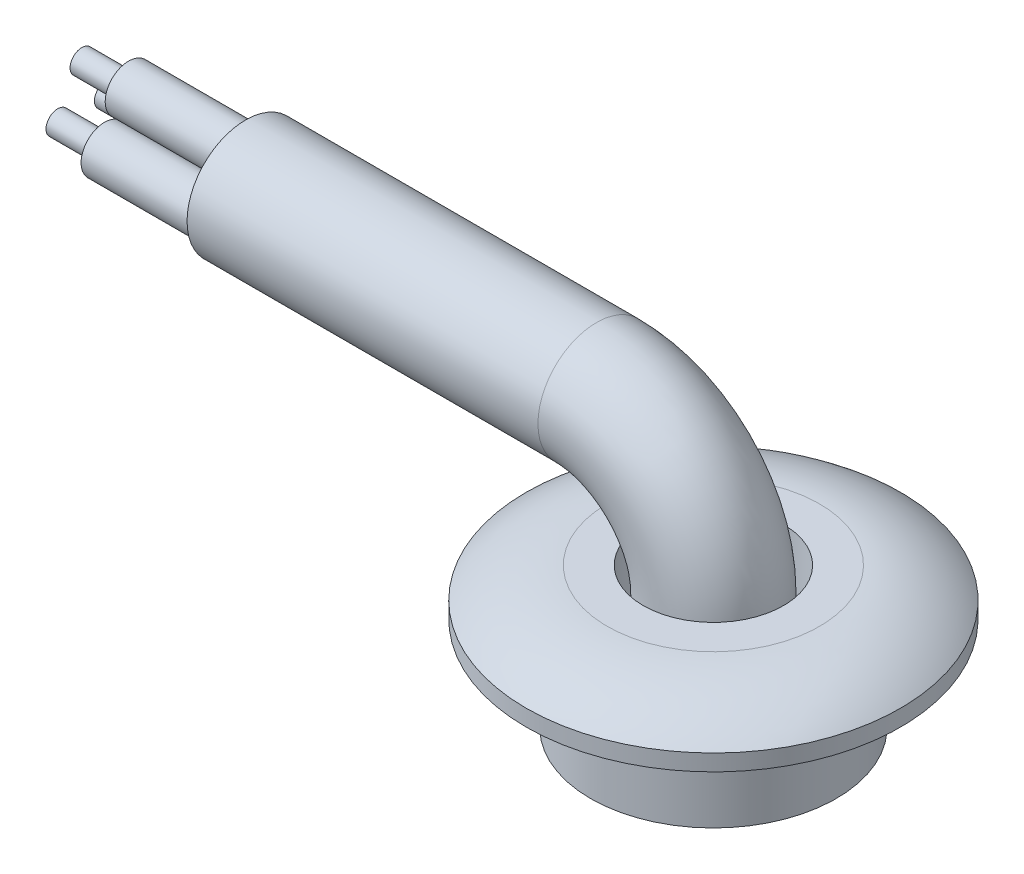
ISO-10303-21;
HEADER;
FILE_DESCRIPTION(('STEP AP214'),'2;1');
FILE_NAME('part.step','',(''),(''),'','','');
FILE_SCHEMA(('AUTOMOTIVE_DESIGN { 1 0 10303 214 1 1 1 1 }'));
ENDSEC;
DATA;
#1=APPLICATION_CONTEXT('core data for automotive mechanical design processes');
#2=APPLICATION_PROTOCOL_DEFINITION('international standard','automotive_design',2000,#1);
#3=PRODUCT_CONTEXT('',#1,'mechanical');
#4=PRODUCT('Part','Part','',(#3));
#5=PRODUCT_RELATED_PRODUCT_CATEGORY('part','',(#4));
#6=PRODUCT_DEFINITION_FORMATION('','',#4);
#7=PRODUCT_DEFINITION_CONTEXT('part definition',#1,'design');
#8=PRODUCT_DEFINITION('design','',#6,#7);
#9=PRODUCT_DEFINITION_SHAPE('','',#8);
#10=(LENGTH_UNIT() NAMED_UNIT(*) SI_UNIT(.MILLI.,.METRE.));
#11=(NAMED_UNIT(*) PLANE_ANGLE_UNIT() SI_UNIT($,.RADIAN.));
#12=(NAMED_UNIT(*) SI_UNIT($,.STERADIAN.) SOLID_ANGLE_UNIT());
#13=UNCERTAINTY_MEASURE_WITH_UNIT(LENGTH_MEASURE(1.E-05),#10,'distance_accuracy_value','');
#14=(GEOMETRIC_REPRESENTATION_CONTEXT(3) GLOBAL_UNCERTAINTY_ASSIGNED_CONTEXT((#13)) GLOBAL_UNIT_ASSIGNED_CONTEXT((#10,
#11,#12)) REPRESENTATION_CONTEXT('',''));
#15=CARTESIAN_POINT('',(0.,0.,0.));
#16=DIRECTION('',(0.,0.,1.));
#17=DIRECTION('',(1.,0.,0.));
#18=AXIS2_PLACEMENT_3D('',#15,#16,#17);
#19=CARTESIAN_POINT('',(0.,0.,0.));
#20=DIRECTION('',(0.,1.,0.));
#21=DIRECTION('',(0.,0.,1.));
#22=AXIS2_PLACEMENT_3D('',#19,#20,#21);
#23=PLANE('',#22);
#24=CARTESIAN_POINT('',(0.,0.,0.));
#25=DIRECTION('',(0.,1.,0.));
#26=DIRECTION('',(0.,0.,1.));
#27=AXIS2_PLACEMENT_3D('',#24,#25,#26);
#28=CIRCLE('',#27,3.);
#29=CARTESIAN_POINT('',(0.,0.,3.));
#30=VERTEX_POINT('',#29);
#31=EDGE_CURVE('P0_E18',#30,#30,#28,.F.);
#32=ORIENTED_EDGE('',*,*,#31,.T.);
#33=EDGE_LOOP('',(#32));
#34=FACE_BOUND('',#33,.T.);
#35=CARTESIAN_POINT('',(0.,1.27502175484295E-13,-1.07937828253817E-12));
#36=DIRECTION('',(0.,1.,0.));
#37=DIRECTION('',(-1.,0.,0.));
#38=AXIS2_PLACEMENT_3D('',#35,#36,#37);
#39=CIRCLE('',#38,4.537919700527);
#40=CARTESIAN_POINT('',(-4.537919700527,1.27303706766758E-13,-1.07937828253817E-12));
#41=VERTEX_POINT('',#40);
#42=EDGE_CURVE('P0_E36',#41,#41,#39,.F.);
#43=ORIENTED_EDGE('',*,*,#42,.F.);
#44=EDGE_LOOP('',(#43));
#45=FACE_BOUND('',#44,.T.);
#46=ADVANCED_FACE('P0_F14',(#34,#45),#23,.T.);
#47=CARTESIAN_POINT('',(0.,0.,0.));
#48=DIRECTION('',(0.,1.,0.));
#49=DIRECTION('',(0.,0.,1.));
#50=AXIS2_PLACEMENT_3D('',#47,#48,#49);
#51=CYLINDRICAL_SURFACE('',#50,3.);
#52=ORIENTED_EDGE('',*,*,#31,.F.);
#53=EDGE_LOOP('',(#52));
#54=FACE_BOUND('',#53,.T.);
#55=CARTESIAN_POINT('',(0.,-6.02,0.));
#56=DIRECTION('',(0.,1.,0.));
#57=DIRECTION('',(0.,0.,1.));
#58=AXIS2_PLACEMENT_3D('',#55,#56,#57);
#59=CIRCLE('',#58,3.);
#60=CARTESIAN_POINT('',(0.,-6.02,3.));
#61=VERTEX_POINT('',#60);
#62=EDGE_CURVE('P0_E34',#61,#61,#59,.F.);
#63=ORIENTED_EDGE('',*,*,#62,.T.);
#64=EDGE_LOOP('',(#63));
#65=FACE_BOUND('',#64,.T.);
#66=ADVANCED_FACE('P0_F45',(#54,#65),#51,.F.);
#67=CARTESIAN_POINT('',(0.,-5.25999999999844,-1.07959431325244E-12));
#68=DIRECTION('',(0.,1.,0.));
#69=DIRECTION('',(-1.,0.,0.));
#70=AXIS2_PLACEMENT_3D('',#67,#68,#69);
#71=DEGENERATE_TOROIDAL_SURFACE('',#70,4.53791970052708,5.25999999999857,.T.);
#72=CARTESIAN_POINT('',(0.,-1.3,0.));
#73=DIRECTION('',(0.,1.,0.));
#74=DIRECTION('',(0.,0.,1.));
#75=AXIS2_PLACEMENT_3D('',#72,#73,#74);
#76=CIRCLE('',#75,8.);
#77=CARTESIAN_POINT('',(0.,-1.3,8.));
#78=VERTEX_POINT('',#77);
#79=EDGE_CURVE('P0_E30',#78,#78,#76,.F.);
#80=ORIENTED_EDGE('',*,*,#79,.F.);
#81=EDGE_LOOP('',(#80));
#82=FACE_BOUND('',#81,.T.);
#83=ORIENTED_EDGE('',*,*,#42,.T.);
#84=EDGE_LOOP('',(#83));
#85=FACE_BOUND('',#84,.T.);
#86=ADVANCED_FACE('P0_F16',(#82,#85),#71,.T.);
#87=CARTESIAN_POINT('',(0.,-6.02,0.));
#88=DIRECTION('',(0.,1.,0.));
#89=DIRECTION('',(0.,0.,1.));
#90=AXIS2_PLACEMENT_3D('',#87,#88,#89);
#91=PLANE('',#90);
#92=ORIENTED_EDGE('',*,*,#62,.F.);
#93=EDGE_LOOP('',(#92));
#94=FACE_BOUND('',#93,.T.);
#95=CARTESIAN_POINT('',(0.,-6.02,0.));
#96=DIRECTION('',(0.,1.,0.));
#97=DIRECTION('',(0.,0.,1.));
#98=AXIS2_PLACEMENT_3D('',#95,#96,#97);
#99=CIRCLE('',#98,5.25);
#100=CARTESIAN_POINT('',(0.,-6.02,5.25));
#101=VERTEX_POINT('',#100);
#102=EDGE_CURVE('P0_E27',#101,#101,#99,.T.);
#103=ORIENTED_EDGE('',*,*,#102,.F.);
#104=EDGE_LOOP('',(#103));
#105=FACE_BOUND('',#104,.T.);
#106=ADVANCED_FACE('P0_F51',(#94,#105),#91,.F.);
#107=CARTESIAN_POINT('',(0.,-6.321,0.));
#108=DIRECTION('',(0.,1.,0.));
#109=DIRECTION('',(0.,0.,1.));
#110=AXIS2_PLACEMENT_3D('',#107,#108,#109);
#111=CYLINDRICAL_SURFACE('',#110,8.);
#112=CARTESIAN_POINT('',(0.,-2.,0.));
#113=DIRECTION('',(0.,1.,0.));
#114=DIRECTION('',(0.,0.,1.));
#115=AXIS2_PLACEMENT_3D('',#112,#113,#114);
#116=CIRCLE('',#115,8.);
#117=CARTESIAN_POINT('',(0.,-2.,8.));
#118=VERTEX_POINT('',#117);
#119=EDGE_CURVE('P0_E22',#118,#118,#116,.T.);
#120=ORIENTED_EDGE('',*,*,#119,.T.);
#121=EDGE_LOOP('',(#120));
#122=FACE_BOUND('',#121,.T.);
#123=ORIENTED_EDGE('',*,*,#79,.T.);
#124=EDGE_LOOP('',(#123));
#125=FACE_BOUND('',#124,.T.);
#126=ADVANCED_FACE('P0_F54',(#122,#125),#111,.T.);
#127=CARTESIAN_POINT('',(0.,-6.321,0.));
#128=DIRECTION('',(0.,1.,0.));
#129=DIRECTION('',(0.,0.,1.));
#130=AXIS2_PLACEMENT_3D('',#127,#128,#129);
#131=CYLINDRICAL_SURFACE('',#130,5.25);
#132=CARTESIAN_POINT('',(0.,-2.,0.));
#133=DIRECTION('',(0.,1.,0.));
#134=DIRECTION('',(0.,0.,1.));
#135=AXIS2_PLACEMENT_3D('',#132,#133,#134);
#136=CIRCLE('',#135,5.25);
#137=CARTESIAN_POINT('',(0.,-2.,5.25));
#138=VERTEX_POINT('',#137);
#139=EDGE_CURVE('P0_E10',#138,#138,#136,.F.);
#140=ORIENTED_EDGE('',*,*,#139,.T.);
#141=EDGE_LOOP('',(#140));
#142=FACE_BOUND('',#141,.T.);
#143=ORIENTED_EDGE('',*,*,#102,.T.);
#144=EDGE_LOOP('',(#143));
#145=FACE_BOUND('',#144,.T.);
#146=ADVANCED_FACE('P0_F58',(#142,#145),#131,.T.);
#147=CARTESIAN_POINT('',(0.,-2.,0.));
#148=DIRECTION('',(0.,1.,0.));
#149=DIRECTION('',(0.,0.,1.));
#150=AXIS2_PLACEMENT_3D('',#147,#148,#149);
#151=PLANE('',#150);
#152=ORIENTED_EDGE('',*,*,#139,.F.);
#153=EDGE_LOOP('',(#152));
#154=FACE_BOUND('',#153,.T.);
#155=ORIENTED_EDGE('',*,*,#119,.F.);
#156=EDGE_LOOP('',(#155));
#157=FACE_BOUND('',#156,.T.);
#158=ADVANCED_FACE('P0_F60',(#154,#157),#151,.F.);
#159=CLOSED_SHELL('',(#46,#66,#86,#106,#126,#146,#158));
#160=MANIFOLD_SOLID_BREP('P0_B1',#159);
#161=CARTESIAN_POINT('',(-27.,0.,0.));
#162=DIRECTION('',(-1.,0.,0.));
#163=DIRECTION('',(0.,0.,1.));
#164=AXIS2_PLACEMENT_3D('',#161,#162,#163);
#165=PLANE('',#164);
#166=CARTESIAN_POINT('',(-27.,5.16,0.));
#167=DIRECTION('',(-1.,0.,0.));
#168=DIRECTION('',(0.,0.,1.));
#169=AXIS2_PLACEMENT_3D('',#166,#167,#168);
#170=CIRCLE('',#169,0.5);
#171=CARTESIAN_POINT('',(-27.,5.16,0.5));
#172=VERTEX_POINT('',#171);
#173=EDGE_CURVE('P1_E17',#172,#172,#170,.F.);
#174=ORIENTED_EDGE('',*,*,#173,.F.);
#175=EDGE_LOOP('',(#174));
#176=FACE_BOUND('',#175,.T.);
#177=ADVANCED_FACE('P1_F14',(#176),#165,.T.);
#178=CARTESIAN_POINT('',(-27.,0.,0.));
#179=DIRECTION('',(-1.,0.,0.));
#180=DIRECTION('',(0.,0.,1.));
#181=AXIS2_PLACEMENT_3D('',#178,#179,#180);
#182=PLANE('',#181);
#183=CARTESIAN_POINT('',(-27.,3.41,-1.04));
#184=DIRECTION('',(-1.,0.,0.));
#185=DIRECTION('',(0.,0.,1.));
#186=AXIS2_PLACEMENT_3D('',#183,#184,#185);
#187=CIRCLE('',#186,0.5);
#188=CARTESIAN_POINT('',(-27.,3.41,-0.54));
#189=VERTEX_POINT('',#188);
#190=EDGE_CURVE('P1_E65',#189,#189,#187,.F.);
#191=ORIENTED_EDGE('',*,*,#190,.F.);
#192=EDGE_LOOP('',(#191));
#193=FACE_BOUND('',#192,.T.);
#194=ADVANCED_FACE('P1_F76',(#193),#182,.T.);
#195=CARTESIAN_POINT('',(-27.,0.,0.));
#196=DIRECTION('',(-1.,0.,0.));
#197=DIRECTION('',(0.,0.,1.));
#198=AXIS2_PLACEMENT_3D('',#195,#196,#197);
#199=PLANE('',#198);
#200=CARTESIAN_POINT('',(-27.,3.41,1.03));
#201=DIRECTION('',(-1.,0.,0.));
#202=DIRECTION('',(0.,0.,1.));
#203=AXIS2_PLACEMENT_3D('',#200,#201,#202);
#204=CIRCLE('',#203,0.5);
#205=CARTESIAN_POINT('',(-27.,3.41,1.53));
#206=VERTEX_POINT('',#205);
#207=EDGE_CURVE('P1_E63',#206,#206,#204,.F.);
#208=ORIENTED_EDGE('',*,*,#207,.F.);
#209=EDGE_LOOP('',(#208));
#210=FACE_BOUND('',#209,.T.);
#211=ADVANCED_FACE('P1_F81',(#210),#199,.T.);
#212=CARTESIAN_POINT('',(-25.,5.16,0.));
#213=DIRECTION('',(-1.,0.,0.));
#214=DIRECTION('',(0.,0.,1.));
#215=AXIS2_PLACEMENT_3D('',#212,#213,#214);
#216=CYLINDRICAL_SURFACE('',#215,0.5);
#217=ORIENTED_EDGE('',*,*,#173,.T.);
#218=EDGE_LOOP('',(#217));
#219=FACE_BOUND('',#218,.T.);
#220=CARTESIAN_POINT('',(-25.,5.16,0.));
#221=DIRECTION('',(-1.,0.,0.));
#222=DIRECTION('',(0.,0.,1.));
#223=AXIS2_PLACEMENT_3D('',#220,#221,#222);
#224=CIRCLE('',#223,0.5);
#225=CARTESIAN_POINT('',(-25.,5.16,0.5));
#226=VERTEX_POINT('',#225);
#227=EDGE_CURVE('P1_E60',#226,#226,#224,.F.);
#228=ORIENTED_EDGE('',*,*,#227,.F.);
#229=EDGE_LOOP('',(#228));
#230=FACE_BOUND('',#229,.T.);
#231=ADVANCED_FACE('P1_F72',(#219,#230),#216,.T.);
#232=CARTESIAN_POINT('',(-25.,3.41,-1.04));
#233=DIRECTION('',(-1.,0.,0.));
#234=DIRECTION('',(0.,0.,1.));
#235=AXIS2_PLACEMENT_3D('',#232,#233,#234);
#236=CYLINDRICAL_SURFACE('',#235,0.5);
#237=ORIENTED_EDGE('',*,*,#190,.T.);
#238=EDGE_LOOP('',(#237));
#239=FACE_BOUND('',#238,.T.);
#240=CARTESIAN_POINT('',(-25.,3.41,-1.04));
#241=DIRECTION('',(-1.,0.,0.));
#242=DIRECTION('',(0.,0.,1.));
#243=AXIS2_PLACEMENT_3D('',#240,#241,#242);
#244=CIRCLE('',#243,0.5);
#245=CARTESIAN_POINT('',(-25.,3.41,-0.54));
#246=VERTEX_POINT('',#245);
#247=EDGE_CURVE('P1_E57',#246,#246,#244,.F.);
#248=ORIENTED_EDGE('',*,*,#247,.F.);
#249=EDGE_LOOP('',(#248));
#250=FACE_BOUND('',#249,.T.);
#251=ADVANCED_FACE('P1_F133',(#239,#250),#236,.T.);
#252=CARTESIAN_POINT('',(-25.,3.41,1.03));
#253=DIRECTION('',(-1.,0.,0.));
#254=DIRECTION('',(0.,0.,1.));
#255=AXIS2_PLACEMENT_3D('',#252,#253,#254);
#256=CYLINDRICAL_SURFACE('',#255,0.5);
#257=ORIENTED_EDGE('',*,*,#207,.T.);
#258=EDGE_LOOP('',(#257));
#259=FACE_BOUND('',#258,.T.);
#260=CARTESIAN_POINT('',(-25.,3.41,1.03));
#261=DIRECTION('',(-1.,0.,0.));
#262=DIRECTION('',(0.,0.,1.));
#263=AXIS2_PLACEMENT_3D('',#260,#261,#262);
#264=CIRCLE('',#263,0.5);
#265=CARTESIAN_POINT('',(-25.,3.41,1.53));
#266=VERTEX_POINT('',#265);
#267=EDGE_CURVE('P1_E54',#266,#266,#264,.F.);
#268=ORIENTED_EDGE('',*,*,#267,.F.);
#269=EDGE_LOOP('',(#268));
#270=FACE_BOUND('',#269,.T.);
#271=ADVANCED_FACE('P1_F129',(#259,#270),#256,.T.);
#272=CARTESIAN_POINT('',(-25.,0.,0.));
#273=DIRECTION('',(-1.,0.,0.));
#274=DIRECTION('',(0.,0.,1.));
#275=AXIS2_PLACEMENT_3D('',#272,#273,#274);
#276=PLANE('',#275);
#277=ORIENTED_EDGE('',*,*,#227,.T.);
#278=EDGE_LOOP('',(#277));
#279=FACE_BOUND('',#278,.T.);
#280=CARTESIAN_POINT('',(-25.,5.16,0.));
#281=DIRECTION('',(-1.,0.,0.));
#282=DIRECTION('',(0.,0.,1.));
#283=AXIS2_PLACEMENT_3D('',#280,#281,#282);
#284=CIRCLE('',#283,1.);
#285=CARTESIAN_POINT('',(-25.,5.16,1.));
#286=VERTEX_POINT('',#285);
#287=EDGE_CURVE('P1_E51',#286,#286,#284,.F.);
#288=ORIENTED_EDGE('',*,*,#287,.F.);
#289=EDGE_LOOP('',(#288));
#290=FACE_BOUND('',#289,.T.);
#291=ADVANCED_FACE('P1_F125',(#279,#290),#276,.T.);
#292=CARTESIAN_POINT('',(-25.,0.,0.));
#293=DIRECTION('',(-1.,0.,0.));
#294=DIRECTION('',(0.,0.,1.));
#295=AXIS2_PLACEMENT_3D('',#292,#293,#294);
#296=PLANE('',#295);
#297=ORIENTED_EDGE('',*,*,#247,.T.);
#298=EDGE_LOOP('',(#297));
#299=FACE_BOUND('',#298,.T.);
#300=CARTESIAN_POINT('',(-25.,3.41,-1.04));
#301=DIRECTION('',(-1.,0.,0.));
#302=DIRECTION('',(0.,0.,1.));
#303=AXIS2_PLACEMENT_3D('',#300,#301,#302);
#304=CIRCLE('',#303,1.);
#305=CARTESIAN_POINT('',(-25.,3.41,-0.0400000000000001));
#306=VERTEX_POINT('',#305);
#307=EDGE_CURVE('P1_E48',#306,#306,#304,.F.);
#308=ORIENTED_EDGE('',*,*,#307,.F.);
#309=EDGE_LOOP('',(#308));
#310=FACE_BOUND('',#309,.T.);
#311=ADVANCED_FACE('P1_F121',(#299,#310),#296,.T.);
#312=CARTESIAN_POINT('',(-25.,0.,0.));
#313=DIRECTION('',(-1.,0.,0.));
#314=DIRECTION('',(0.,0.,1.));
#315=AXIS2_PLACEMENT_3D('',#312,#313,#314);
#316=PLANE('',#315);
#317=ORIENTED_EDGE('',*,*,#267,.T.);
#318=EDGE_LOOP('',(#317));
#319=FACE_BOUND('',#318,.T.);
#320=CARTESIAN_POINT('',(-25.,3.41,1.03));
#321=DIRECTION('',(-1.,0.,0.));
#322=DIRECTION('',(0.,0.,1.));
#323=AXIS2_PLACEMENT_3D('',#320,#321,#322);
#324=CIRCLE('',#323,1.);
#325=CARTESIAN_POINT('',(-25.,3.41,2.03));
#326=VERTEX_POINT('',#325);
#327=EDGE_CURVE('P1_E45',#326,#326,#324,.F.);
#328=ORIENTED_EDGE('',*,*,#327,.F.);
#329=EDGE_LOOP('',(#328));
#330=FACE_BOUND('',#329,.T.);
#331=ADVANCED_FACE('P1_F117',(#319,#330),#316,.T.);
#332=CARTESIAN_POINT('',(0.,-6.02,0.));
#333=DIRECTION('',(0.,1.,0.));
#334=DIRECTION('',(0.,0.,1.));
#335=AXIS2_PLACEMENT_3D('',#332,#333,#334);
#336=PLANE('',#335);
#337=CARTESIAN_POINT('',(0.,-6.02,0.));
#338=DIRECTION('',(0.,1.,0.));
#339=DIRECTION('',(0.,0.,1.));
#340=AXIS2_PLACEMENT_3D('',#337,#338,#339);
#341=CIRCLE('',#340,2.5);
#342=CARTESIAN_POINT('',(0.,-6.02,2.5));
#343=VERTEX_POINT('',#342);
#344=EDGE_CURVE('P1_E42',#343,#343,#341,.T.);
#345=ORIENTED_EDGE('',*,*,#344,.F.);
#346=EDGE_LOOP('',(#345));
#347=FACE_BOUND('',#346,.T.);
#348=ADVANCED_FACE('P1_F113',(#347),#336,.F.);
#349=CARTESIAN_POINT('',(-20.,5.16,0.));
#350=DIRECTION('',(-1.,0.,0.));
#351=DIRECTION('',(0.,0.,1.));
#352=AXIS2_PLACEMENT_3D('',#349,#350,#351);
#353=CYLINDRICAL_SURFACE('',#352,1.);
#354=ORIENTED_EDGE('',*,*,#287,.T.);
#355=EDGE_LOOP('',(#354));
#356=FACE_BOUND('',#355,.T.);
#357=CARTESIAN_POINT('',(-20.,5.16,0.));
#358=DIRECTION('',(-1.,0.,0.));
#359=DIRECTION('',(0.,0.,1.));
#360=AXIS2_PLACEMENT_3D('',#357,#358,#359);
#361=CIRCLE('',#360,1.);
#362=CARTESIAN_POINT('',(-20.,5.16,1.));
#363=VERTEX_POINT('',#362);
#364=EDGE_CURVE('P1_E39',#363,#363,#361,.F.);
#365=ORIENTED_EDGE('',*,*,#364,.F.);
#366=EDGE_LOOP('',(#365));
#367=FACE_BOUND('',#366,.T.);
#368=ADVANCED_FACE('P1_F109',(#356,#367),#353,.T.);
#369=CARTESIAN_POINT('',(-20.,3.41,-1.04));
#370=DIRECTION('',(-1.,0.,0.));
#371=DIRECTION('',(0.,0.,1.));
#372=AXIS2_PLACEMENT_3D('',#369,#370,#371);
#373=CYLINDRICAL_SURFACE('',#372,1.);
#374=ORIENTED_EDGE('',*,*,#307,.T.);
#375=EDGE_LOOP('',(#374));
#376=FACE_BOUND('',#375,.T.);
#377=CARTESIAN_POINT('',(-20.,3.41,-1.04));
#378=DIRECTION('',(-1.,0.,0.));
#379=DIRECTION('',(0.,0.,1.));
#380=AXIS2_PLACEMENT_3D('',#377,#378,#379);
#381=CIRCLE('',#380,1.);
#382=CARTESIAN_POINT('',(-20.,3.41,-0.0400000000000001));
#383=VERTEX_POINT('',#382);
#384=EDGE_CURVE('P1_E36',#383,#383,#381,.F.);
#385=ORIENTED_EDGE('',*,*,#384,.F.);
#386=EDGE_LOOP('',(#385));
#387=FACE_BOUND('',#386,.T.);
#388=ADVANCED_FACE('P1_F105',(#376,#387),#373,.T.);
#389=CARTESIAN_POINT('',(-20.,3.41,1.03));
#390=DIRECTION('',(-1.,0.,0.));
#391=DIRECTION('',(0.,0.,1.));
#392=AXIS2_PLACEMENT_3D('',#389,#390,#391);
#393=CYLINDRICAL_SURFACE('',#392,1.);
#394=ORIENTED_EDGE('',*,*,#327,.T.);
#395=EDGE_LOOP('',(#394));
#396=FACE_BOUND('',#395,.T.);
#397=CARTESIAN_POINT('',(-20.,3.41,1.03));
#398=DIRECTION('',(-1.,0.,0.));
#399=DIRECTION('',(0.,0.,1.));
#400=AXIS2_PLACEMENT_3D('',#397,#398,#399);
#401=CIRCLE('',#400,1.);
#402=CARTESIAN_POINT('',(-20.,3.41,2.03));
#403=VERTEX_POINT('',#402);
#404=EDGE_CURVE('P1_E32',#403,#403,#401,.F.);
#405=ORIENTED_EDGE('',*,*,#404,.F.);
#406=EDGE_LOOP('',(#405));
#407=FACE_BOUND('',#406,.T.);
#408=ADVANCED_FACE('P1_F101',(#396,#407),#393,.T.);
#409=CARTESIAN_POINT('',(0.,-6.02,0.));
#410=DIRECTION('',(0.,1.,0.));
#411=DIRECTION('',(0.,0.,1.));
#412=AXIS2_PLACEMENT_3D('',#409,#410,#411);
#413=CYLINDRICAL_SURFACE('',#412,2.5);
#414=CARTESIAN_POINT('',(0.,-1.02,0.));
#415=DIRECTION('',(0.,1.,0.));
#416=DIRECTION('',(1.,0.,0.));
#417=AXIS2_PLACEMENT_3D('',#414,#415,#416);
#418=CIRCLE('',#417,2.5);
#419=CARTESIAN_POINT('',(2.5,-1.02,0.));
#420=VERTEX_POINT('',#419);
#421=EDGE_CURVE('P1_E26',#420,#420,#418,.T.);
#422=ORIENTED_EDGE('',*,*,#421,.F.);
#423=EDGE_LOOP('',(#422));
#424=FACE_BOUND('',#423,.T.);
#425=ORIENTED_EDGE('',*,*,#344,.T.);
#426=EDGE_LOOP('',(#425));
#427=FACE_BOUND('',#426,.T.);
#428=ADVANCED_FACE('P1_F97',(#424,#427),#413,.T.);
#429=CARTESIAN_POINT('',(-20.,3.98,0.));
#430=DIRECTION('',(-1.,0.,0.));
#431=DIRECTION('',(0.,0.,1.));
#432=AXIS2_PLACEMENT_3D('',#429,#430,#431);
#433=PLANE('',#432);
#434=ORIENTED_EDGE('',*,*,#404,.T.);
#435=EDGE_LOOP('',(#434));
#436=FACE_BOUND('',#435,.T.);
#437=ORIENTED_EDGE('',*,*,#384,.T.);
#438=EDGE_LOOP('',(#437));
#439=FACE_BOUND('',#438,.T.);
#440=ORIENTED_EDGE('',*,*,#364,.T.);
#441=EDGE_LOOP('',(#440));
#442=FACE_BOUND('',#441,.T.);
#443=CARTESIAN_POINT('',(-20.,3.98,0.));
#444=DIRECTION('',(-1.,0.,0.));
#445=DIRECTION('',(0.,0.,1.));
#446=AXIS2_PLACEMENT_3D('',#443,#444,#445);
#447=CIRCLE('',#446,2.5);
#448=CARTESIAN_POINT('',(-20.,3.98,2.5));
#449=VERTEX_POINT('',#448);
#450=EDGE_CURVE('P1_E21',#449,#449,#447,.F.);
#451=ORIENTED_EDGE('',*,*,#450,.F.);
#452=EDGE_LOOP('',(#451));
#453=FACE_BOUND('',#452,.T.);
#454=ADVANCED_FACE('P1_F91',(#436,#439,#442,#453),#433,.T.);
#455=CARTESIAN_POINT('',(-5.,-1.02,0.));
#456=DIRECTION('',(0.,0.,1.));
#457=DIRECTION('',(-1.,0.,0.));
#458=AXIS2_PLACEMENT_3D('',#455,#456,#457);
#459=TOROIDAL_SURFACE('',#458,5.,2.5);
#460=CARTESIAN_POINT('',(-5.,3.98,0.));
#461=DIRECTION('',(-1.,0.,0.));
#462=DIRECTION('',(0.,0.,1.));
#463=AXIS2_PLACEMENT_3D('',#460,#461,#462);
#464=CIRCLE('',#463,2.5);
#465=CARTESIAN_POINT('',(-5.,3.98,2.5));
#466=VERTEX_POINT('',#465);
#467=EDGE_CURVE('P1_E10',#466,#466,#464,.T.);
#468=ORIENTED_EDGE('',*,*,#467,.F.);
#469=EDGE_LOOP('',(#468));
#470=FACE_BOUND('',#469,.T.);
#471=ORIENTED_EDGE('',*,*,#421,.T.);
#472=EDGE_LOOP('',(#471));
#473=FACE_BOUND('',#472,.T.);
#474=ADVANCED_FACE('P1_F85',(#470,#473),#459,.T.);
#475=CARTESIAN_POINT('',(-5.,3.98,0.));
#476=DIRECTION('',(-1.,0.,0.));
#477=DIRECTION('',(0.,0.,1.));
#478=AXIS2_PLACEMENT_3D('',#475,#476,#477);
#479=CYLINDRICAL_SURFACE('',#478,2.5);
#480=ORIENTED_EDGE('',*,*,#450,.T.);
#481=EDGE_LOOP('',(#480));
#482=FACE_BOUND('',#481,.T.);
#483=ORIENTED_EDGE('',*,*,#467,.T.);
#484=EDGE_LOOP('',(#483));
#485=FACE_BOUND('',#484,.T.);
#486=ADVANCED_FACE('P1_F83',(#482,#485),#479,.T.);
#487=CLOSED_SHELL('',(#177,#194,#211,#231,#251,#271,#291,#311,#331,#348,#368,#388,#408,#428,
#454,#474,#486));
#488=MANIFOLD_SOLID_BREP('P1_B1',#487);
#489=ADVANCED_BREP_SHAPE_REPRESENTATION('',(#18,#160,#488),#14);
#490=SHAPE_DEFINITION_REPRESENTATION(#9,#489);
ENDSEC;
END-ISO-10303-21;
